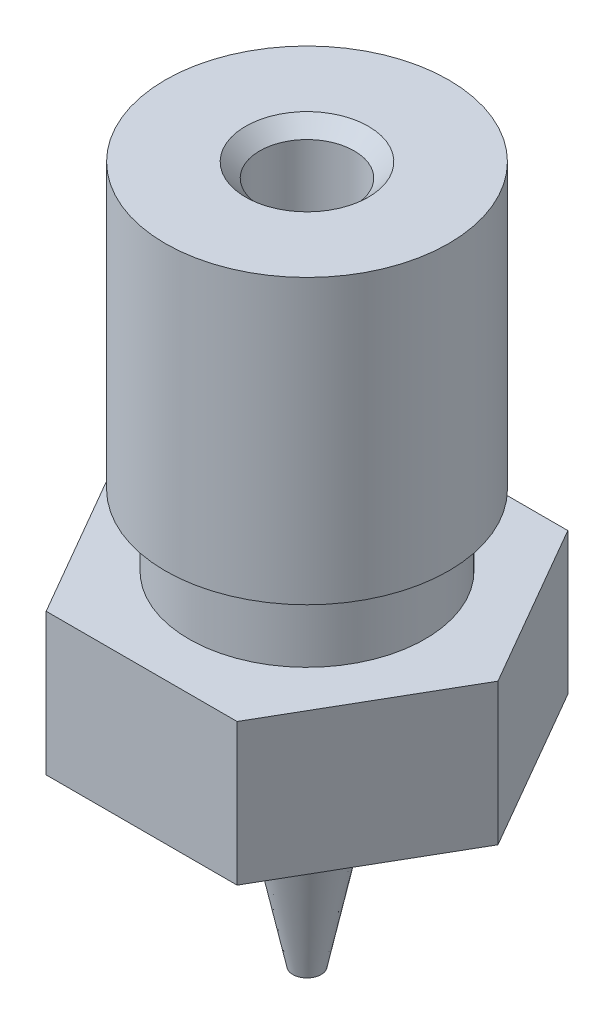
ISO-10303-21;
HEADER;
FILE_DESCRIPTION(('STEP AP214'),'2;1');
FILE_NAME('part.step','',(''),(''),'','','');
FILE_SCHEMA(('AUTOMOTIVE_DESIGN { 1 0 10303 214 1 1 1 1 }'));
ENDSEC;
DATA;
#1=APPLICATION_CONTEXT('core data for automotive mechanical design processes');
#2=APPLICATION_PROTOCOL_DEFINITION('international standard','automotive_design',2000,#1);
#3=PRODUCT_CONTEXT('',#1,'mechanical');
#4=PRODUCT('Part','Part','',(#3));
#5=PRODUCT_RELATED_PRODUCT_CATEGORY('part','',(#4));
#6=PRODUCT_DEFINITION_FORMATION('','',#4);
#7=PRODUCT_DEFINITION_CONTEXT('part definition',#1,'design');
#8=PRODUCT_DEFINITION('design','',#6,#7);
#9=PRODUCT_DEFINITION_SHAPE('','',#8);
#10=(LENGTH_UNIT() NAMED_UNIT(*) SI_UNIT(.MILLI.,.METRE.));
#11=(NAMED_UNIT(*) PLANE_ANGLE_UNIT() SI_UNIT($,.RADIAN.));
#12=(NAMED_UNIT(*) SI_UNIT($,.STERADIAN.) SOLID_ANGLE_UNIT());
#13=UNCERTAINTY_MEASURE_WITH_UNIT(LENGTH_MEASURE(1.E-05),#10,'distance_accuracy_value','');
#14=(GEOMETRIC_REPRESENTATION_CONTEXT(3) GLOBAL_UNCERTAINTY_ASSIGNED_CONTEXT((#13)) GLOBAL_UNIT_ASSIGNED_CONTEXT((#10,
#11,#12)) REPRESENTATION_CONTEXT('',''));
#15=CARTESIAN_POINT('',(0.,0.,0.));
#16=DIRECTION('',(0.,0.,1.));
#17=DIRECTION('',(1.,0.,0.));
#18=AXIS2_PLACEMENT_3D('',#15,#16,#17);
#19=CARTESIAN_POINT('',(0.,0.,0.));
#20=DIRECTION('',(0.,1.,0.));
#21=DIRECTION('',(-1.,0.,0.));
#22=AXIS2_PLACEMENT_3D('',#19,#20,#21);
#23=CONICAL_SURFACE('',#22,0.500000000000001,0.610865238198013);
#24=CARTESIAN_POINT('',(0.,2.,0.));
#25=DIRECTION('',(0.,1.,0.));
#26=DIRECTION('',(-1.,0.,0.));
#27=AXIS2_PLACEMENT_3D('',#24,#25,#26);
#28=CIRCLE('',#27,1.90041507641941);
#29=CARTESIAN_POINT('',(-1.90041507641941,2.,0.));
#30=VERTEX_POINT('',#29);
#31=EDGE_CURVE('E78',#30,#30,#28,.T.);
#32=ORIENTED_EDGE('',*,*,#31,.F.);
#33=EDGE_LOOP('',(#32));
#34=FACE_BOUND('',#33,.T.);
#35=CARTESIAN_POINT('',(0.,1.1425184053937,0.));
#36=DIRECTION('',(0.,1.,0.));
#37=DIRECTION('',(-1.,0.,0.));
#38=AXIS2_PLACEMENT_3D('',#35,#36,#37);
#39=CIRCLE('',#38,1.3);
#40=CARTESIAN_POINT('',(-1.3,1.1425184053937,0.));
#41=VERTEX_POINT('',#40);
#42=EDGE_CURVE('E12',#41,#41,#39,.F.);
#43=ORIENTED_EDGE('',*,*,#42,.F.);
#44=EDGE_LOOP('',(#43));
#45=FACE_BOUND('',#44,.T.);
#46=ADVANCED_FACE('F70',(#34,#45),#23,.T.);
#47=CARTESIAN_POINT('',(1.90041507641941,2.,0.));
#48=DIRECTION('',(0.,1.,0.));
#49=DIRECTION('',(-1.,0.,0.));
#50=AXIS2_PLACEMENT_3D('',#47,#48,#49);
#51=PLANE('',#50);
#52=DIRECTION('',(0.499999999999999,0.,0.866025403784439));
#53=VECTOR('',#52,1.);
#54=CARTESIAN_POINT('',(3.03108891324554,2.,-1.75));
#55=LINE('',#54,#53);
#56=CARTESIAN_POINT('',(2.02072594216369,2.,-3.5));
#57=VERTEX_POINT('',#56);
#58=CARTESIAN_POINT('',(4.04145188432738,2.,0.));
#59=VERTEX_POINT('',#58);
#60=EDGE_CURVE('E155',#57,#59,#55,.T.);
#61=ORIENTED_EDGE('',*,*,#60,.T.);
#62=DIRECTION('',(-0.5,0.,0.866025403784439));
#63=VECTOR('',#62,1.);
#64=CARTESIAN_POINT('',(3.03108891324553,2.,1.75));
#65=LINE('',#64,#63);
#66=CARTESIAN_POINT('',(2.02072594216369,2.,3.5));
#67=VERTEX_POINT('',#66);
#68=EDGE_CURVE('E142',#59,#67,#65,.T.);
#69=ORIENTED_EDGE('',*,*,#68,.T.);
#70=DIRECTION('',(-1.,0.,0.));
#71=VECTOR('',#70,1.);
#72=CARTESIAN_POINT('',(0.,2.,3.5));
#73=LINE('',#72,#71);
#74=CARTESIAN_POINT('',(-2.02072594216369,2.,3.5));
#75=VERTEX_POINT('',#74);
#76=EDGE_CURVE('E166',#67,#75,#73,.T.);
#77=ORIENTED_EDGE('',*,*,#76,.T.);
#78=DIRECTION('',(-0.5,0.,-0.866025403784439));
#79=VECTOR('',#78,1.);
#80=CARTESIAN_POINT('',(-3.03108891324554,2.,1.75));
#81=LINE('',#80,#79);
#82=CARTESIAN_POINT('',(-4.04145188432738,2.,0.));
#83=VERTEX_POINT('',#82);
#84=EDGE_CURVE('E169',#75,#83,#81,.T.);
#85=ORIENTED_EDGE('',*,*,#84,.T.);
#86=DIRECTION('',(0.5,0.,-0.866025403784438));
#87=VECTOR('',#86,1.);
#88=CARTESIAN_POINT('',(-3.03108891324553,2.,-1.75));
#89=LINE('',#88,#87);
#90=CARTESIAN_POINT('',(-2.02072594216369,2.,-3.5));
#91=VERTEX_POINT('',#90);
#92=EDGE_CURVE('E175',#83,#91,#89,.T.);
#93=ORIENTED_EDGE('',*,*,#92,.T.);
#94=DIRECTION('',(1.,0.,0.));
#95=VECTOR('',#94,1.);
#96=CARTESIAN_POINT('',(0.,2.,-3.5));
#97=LINE('',#96,#95);
#98=EDGE_CURVE('E148',#91,#57,#97,.T.);
#99=ORIENTED_EDGE('',*,*,#98,.T.);
#100=EDGE_LOOP('',(#61,#69,#77,#85,#93,#99));
#101=FACE_BOUND('',#100,.T.);
#102=ORIENTED_EDGE('',*,*,#31,.T.);
#103=EDGE_LOOP('',(#102));
#104=FACE_BOUND('',#103,.T.);
#105=ADVANCED_FACE('F207',(#101,#104),#51,.F.);
#106=CARTESIAN_POINT('',(3.5,5.,0.));
#107=DIRECTION('',(0.,-1.,0.));
#108=DIRECTION('',(1.,0.,0.));
#109=AXIS2_PLACEMENT_3D('',#106,#107,#108);
#110=PLANE('',#109);
#111=CARTESIAN_POINT('',(0.,5.,0.));
#112=DIRECTION('',(0.,1.,0.));
#113=DIRECTION('',(-1.,0.,0.));
#114=AXIS2_PLACEMENT_3D('',#111,#112,#113);
#115=CIRCLE('',#114,2.5);
#116=CARTESIAN_POINT('',(-2.5,5.,0.));
#117=VERTEX_POINT('',#116);
#118=EDGE_CURVE('E202',#117,#117,#115,.T.);
#119=ORIENTED_EDGE('',*,*,#118,.F.);
#120=EDGE_LOOP('',(#119));
#121=FACE_BOUND('',#120,.T.);
#122=DIRECTION('',(-0.5,0.,-0.866025403784439));
#123=VECTOR('',#122,1.);
#124=CARTESIAN_POINT('',(-3.03108891324554,5.,1.75));
#125=LINE('',#124,#123);
#126=CARTESIAN_POINT('',(-2.02072594216369,5.,3.5));
#127=VERTEX_POINT('',#126);
#128=CARTESIAN_POINT('',(-4.04145188432738,5.,0.));
#129=VERTEX_POINT('',#128);
#130=EDGE_CURVE('E171',#127,#129,#125,.T.);
#131=ORIENTED_EDGE('',*,*,#130,.F.);
#132=DIRECTION('',(-1.,0.,0.));
#133=VECTOR('',#132,1.);
#134=CARTESIAN_POINT('',(0.,5.,3.5));
#135=LINE('',#134,#133);
#136=CARTESIAN_POINT('',(2.02072594216369,5.,3.5));
#137=VERTEX_POINT('',#136);
#138=EDGE_CURVE('E125',#137,#127,#135,.T.);
#139=ORIENTED_EDGE('',*,*,#138,.F.);
#140=DIRECTION('',(-0.5,0.,0.866025403784439));
#141=VECTOR('',#140,1.);
#142=CARTESIAN_POINT('',(3.03108891324553,5.,1.75));
#143=LINE('',#142,#141);
#144=CARTESIAN_POINT('',(4.04145188432738,5.,0.));
#145=VERTEX_POINT('',#144);
#146=EDGE_CURVE('E118',#145,#137,#143,.T.);
#147=ORIENTED_EDGE('',*,*,#146,.F.);
#148=DIRECTION('',(0.499999999999999,0.,0.866025403784439));
#149=VECTOR('',#148,1.);
#150=CARTESIAN_POINT('',(3.03108891324554,5.,-1.75));
#151=LINE('',#150,#149);
#152=CARTESIAN_POINT('',(2.02072594216369,5.,-3.5));
#153=VERTEX_POINT('',#152);
#154=EDGE_CURVE('E122',#153,#145,#151,.T.);
#155=ORIENTED_EDGE('',*,*,#154,.F.);
#156=DIRECTION('',(1.,0.,0.));
#157=VECTOR('',#156,1.);
#158=CARTESIAN_POINT('',(0.,5.,-3.5));
#159=LINE('',#158,#157);
#160=CARTESIAN_POINT('',(-2.02072594216369,5.,-3.5));
#161=VERTEX_POINT('',#160);
#162=EDGE_CURVE('E138',#161,#153,#159,.T.);
#163=ORIENTED_EDGE('',*,*,#162,.F.);
#164=DIRECTION('',(0.5,0.,-0.866025403784438));
#165=VECTOR('',#164,1.);
#166=CARTESIAN_POINT('',(-3.03108891324553,5.,-1.75));
#167=LINE('',#166,#165);
#168=EDGE_CURVE('E174',#129,#161,#167,.T.);
#169=ORIENTED_EDGE('',*,*,#168,.F.);
#170=EDGE_LOOP('',(#131,#139,#147,#155,#163,#169));
#171=FACE_BOUND('',#170,.T.);
#172=ADVANCED_FACE('F120',(#121,#171),#110,.F.);
#173=CARTESIAN_POINT('',(0.,-1.12913310004202,0.));
#174=DIRECTION('',(0.,1.,0.));
#175=DIRECTION('',(-1.,0.,0.));
#176=AXIS2_PLACEMENT_3D('',#173,#174,#175);
#177=CYLINDRICAL_SURFACE('',#176,2.5);
#178=CARTESIAN_POINT('',(0.,6.5,0.));
#179=DIRECTION('',(0.,1.,0.));
#180=DIRECTION('',(-1.,0.,0.));
#181=AXIS2_PLACEMENT_3D('',#178,#179,#180);
#182=CIRCLE('',#181,2.5);
#183=CARTESIAN_POINT('',(-2.5,6.5,0.));
#184=VERTEX_POINT('',#183);
#185=EDGE_CURVE('E199',#184,#184,#182,.T.);
#186=ORIENTED_EDGE('',*,*,#185,.F.);
#187=EDGE_LOOP('',(#186));
#188=FACE_BOUND('',#187,.T.);
#189=ORIENTED_EDGE('',*,*,#118,.T.);
#190=EDGE_LOOP('',(#189));
#191=FACE_BOUND('',#190,.T.);
#192=ADVANCED_FACE('F283',(#188,#191),#177,.T.);
#193=CARTESIAN_POINT('',(2.5,6.5,0.));
#194=DIRECTION('',(0.,1.,0.));
#195=DIRECTION('',(-1.,0.,0.));
#196=AXIS2_PLACEMENT_3D('',#193,#194,#195);
#197=PLANE('',#196);
#198=CARTESIAN_POINT('',(0.,6.5,0.));
#199=DIRECTION('',(0.,1.,0.));
#200=DIRECTION('',(-1.,0.,0.));
#201=AXIS2_PLACEMENT_3D('',#198,#199,#200);
#202=CIRCLE('',#201,3.);
#203=CARTESIAN_POINT('',(-3.,6.5,0.));
#204=VERTEX_POINT('',#203);
#205=EDGE_CURVE('E196',#204,#204,#202,.T.);
#206=ORIENTED_EDGE('',*,*,#205,.F.);
#207=EDGE_LOOP('',(#206));
#208=FACE_BOUND('',#207,.T.);
#209=ORIENTED_EDGE('',*,*,#185,.T.);
#210=EDGE_LOOP('',(#209));
#211=FACE_BOUND('',#210,.T.);
#212=ADVANCED_FACE('F279',(#208,#211),#197,.F.);
#213=CARTESIAN_POINT('',(0.,-1.12913310004202,0.));
#214=DIRECTION('',(0.,1.,0.));
#215=DIRECTION('',(-1.,0.,0.));
#216=AXIS2_PLACEMENT_3D('',#213,#214,#215);
#217=CYLINDRICAL_SURFACE('',#216,3.);
#218=CARTESIAN_POINT('',(0.,12.5,0.));
#219=DIRECTION('',(0.,1.,0.));
#220=DIRECTION('',(-1.,0.,0.));
#221=AXIS2_PLACEMENT_3D('',#218,#219,#220);
#222=CIRCLE('',#221,3.);
#223=CARTESIAN_POINT('',(-3.,12.5,0.));
#224=VERTEX_POINT('',#223);
#225=EDGE_CURVE('E193',#224,#224,#222,.T.);
#226=ORIENTED_EDGE('',*,*,#225,.F.);
#227=EDGE_LOOP('',(#226));
#228=FACE_BOUND('',#227,.T.);
#229=ORIENTED_EDGE('',*,*,#205,.T.);
#230=EDGE_LOOP('',(#229));
#231=FACE_BOUND('',#230,.T.);
#232=ADVANCED_FACE('F275',(#228,#231),#217,.T.);
#233=CARTESIAN_POINT('',(3.,12.5,0.));
#234=DIRECTION('',(0.,-1.,0.));
#235=DIRECTION('',(1.,0.,0.));
#236=AXIS2_PLACEMENT_3D('',#233,#234,#235);
#237=PLANE('',#236);
#238=CARTESIAN_POINT('',(0.,12.5,0.));
#239=DIRECTION('',(0.,-1.,0.));
#240=DIRECTION('',(0.,0.,-1.));
#241=AXIS2_PLACEMENT_3D('',#238,#239,#240);
#242=CIRCLE('',#241,1.3);
#243=CARTESIAN_POINT('',(0.,12.5,-1.3));
#244=VERTEX_POINT('',#243);
#245=EDGE_CURVE('E190',#244,#244,#242,.T.);
#246=ORIENTED_EDGE('',*,*,#245,.T.);
#247=EDGE_LOOP('',(#246));
#248=FACE_BOUND('',#247,.T.);
#249=ORIENTED_EDGE('',*,*,#225,.T.);
#250=EDGE_LOOP('',(#249));
#251=FACE_BOUND('',#250,.T.);
#252=ADVANCED_FACE('F271',(#248,#251),#237,.F.);
#253=CARTESIAN_POINT('',(0.,12.2,0.));
#254=DIRECTION('',(0.,1.,0.));
#255=DIRECTION('',(0.,0.,1.));
#256=AXIS2_PLACEMENT_3D('',#253,#254,#255);
#257=CONICAL_SURFACE('',#256,1.,0.785398163397445);
#258=ORIENTED_EDGE('',*,*,#245,.F.);
#259=EDGE_LOOP('',(#258));
#260=FACE_BOUND('',#259,.T.);
#261=CARTESIAN_POINT('',(0.,12.2,0.));
#262=DIRECTION('',(0.,-1.,0.));
#263=DIRECTION('',(0.,0.,-1.));
#264=AXIS2_PLACEMENT_3D('',#261,#262,#263);
#265=CIRCLE('',#264,1.);
#266=CARTESIAN_POINT('',(0.,12.2,-1.));
#267=VERTEX_POINT('',#266);
#268=EDGE_CURVE('E187',#267,#267,#265,.T.);
#269=ORIENTED_EDGE('',*,*,#268,.T.);
#270=EDGE_LOOP('',(#269));
#271=FACE_BOUND('',#270,.T.);
#272=ADVANCED_FACE('F267',(#260,#271),#257,.F.);
#273=CARTESIAN_POINT('',(0.,0.,0.));
#274=DIRECTION('',(0.,-1.,0.));
#275=DIRECTION('',(0.,0.,-1.));
#276=AXIS2_PLACEMENT_3D('',#273,#274,#275);
#277=CYLINDRICAL_SURFACE('',#276,1.);
#278=ORIENTED_EDGE('',*,*,#268,.F.);
#279=EDGE_LOOP('',(#278));
#280=FACE_BOUND('',#279,.T.);
#281=CARTESIAN_POINT('',(0.,1.9856406460551,0.));
#282=DIRECTION('',(0.,-1.,0.));
#283=DIRECTION('',(0.,0.,-1.));
#284=AXIS2_PLACEMENT_3D('',#281,#282,#283);
#285=CIRCLE('',#284,1.);
#286=CARTESIAN_POINT('',(0.,1.9856406460551,-1.));
#287=VERTEX_POINT('',#286);
#288=EDGE_CURVE('E184',#287,#287,#285,.T.);
#289=ORIENTED_EDGE('',*,*,#288,.T.);
#290=EDGE_LOOP('',(#289));
#291=FACE_BOUND('',#290,.T.);
#292=ADVANCED_FACE('F263',(#280,#291),#277,.F.);
#293=CARTESIAN_POINT('',(0.,0.6,0.));
#294=DIRECTION('',(0.,1.,0.));
#295=DIRECTION('',(0.,0.,1.));
#296=AXIS2_PLACEMENT_3D('',#293,#294,#295);
#297=CONICAL_SURFACE('',#296,0.2,0.5235987755983);
#298=ORIENTED_EDGE('',*,*,#288,.F.);
#299=EDGE_LOOP('',(#298));
#300=FACE_BOUND('',#299,.T.);
#301=CARTESIAN_POINT('',(0.,0.6,0.));
#302=DIRECTION('',(0.,-1.,0.));
#303=DIRECTION('',(0.,0.,-1.));
#304=AXIS2_PLACEMENT_3D('',#301,#302,#303);
#305=CIRCLE('',#304,0.2);
#306=CARTESIAN_POINT('',(0.,0.6,-0.2));
#307=VERTEX_POINT('',#306);
#308=EDGE_CURVE('E181',#307,#307,#305,.T.);
#309=ORIENTED_EDGE('',*,*,#308,.T.);
#310=EDGE_LOOP('',(#309));
#311=FACE_BOUND('',#310,.T.);
#312=ADVANCED_FACE('F259',(#300,#311),#297,.F.);
#313=CARTESIAN_POINT('',(0.,0.,0.));
#314=DIRECTION('',(0.,-1.,0.));
#315=DIRECTION('',(0.,0.,-1.));
#316=AXIS2_PLACEMENT_3D('',#313,#314,#315);
#317=CYLINDRICAL_SURFACE('',#316,0.2);
#318=ORIENTED_EDGE('',*,*,#308,.F.);
#319=EDGE_LOOP('',(#318));
#320=FACE_BOUND('',#319,.T.);
#321=CARTESIAN_POINT('',(0.,0.,0.));
#322=DIRECTION('',(0.,1.,0.));
#323=DIRECTION('',(-1.,0.,0.));
#324=AXIS2_PLACEMENT_3D('',#321,#322,#323);
#325=CIRCLE('',#324,0.200000000000001);
#326=CARTESIAN_POINT('',(-0.200000000000001,0.,0.));
#327=VERTEX_POINT('',#326);
#328=EDGE_CURVE('E145',#327,#327,#325,.T.);
#329=ORIENTED_EDGE('',*,*,#328,.F.);
#330=EDGE_LOOP('',(#329));
#331=FACE_BOUND('',#330,.T.);
#332=ADVANCED_FACE('F255',(#320,#331),#317,.F.);
#333=CARTESIAN_POINT('',(-3.03108891324554,5.,1.75));
#334=DIRECTION('',(-0.866025403784439,0.,0.5));
#335=DIRECTION('',(0.5,0.,0.866025403784439));
#336=AXIS2_PLACEMENT_3D('',#333,#334,#335);
#337=PLANE('',#336);
#338=ORIENTED_EDGE('',*,*,#84,.F.);
#339=DIRECTION('',(0.,-1.,0.));
#340=VECTOR('',#339,1.);
#341=CARTESIAN_POINT('',(-2.02072594216369,5.,3.5));
#342=LINE('',#341,#340);
#343=EDGE_CURVE('E163',#127,#75,#342,.T.);
#344=ORIENTED_EDGE('',*,*,#343,.F.);
#345=ORIENTED_EDGE('',*,*,#130,.T.);
#346=DIRECTION('',(0.,-1.,0.));
#347=VECTOR('',#346,1.);
#348=CARTESIAN_POINT('',(-4.04145188432738,5.,0.));
#349=LINE('',#348,#347);
#350=EDGE_CURVE('E84',#129,#83,#349,.T.);
#351=ORIENTED_EDGE('',*,*,#350,.T.);
#352=EDGE_LOOP('',(#338,#344,#345,#351));
#353=FACE_BOUND('',#352,.T.);
#354=ADVANCED_FACE('F252',(#353),#337,.T.);
#355=CARTESIAN_POINT('',(-3.03108891324553,5.,-1.75));
#356=DIRECTION('',(-0.866025403784438,0.,-0.5));
#357=DIRECTION('',(-0.5,0.,0.866025403784439));
#358=AXIS2_PLACEMENT_3D('',#355,#356,#357);
#359=PLANE('',#358);
#360=ORIENTED_EDGE('',*,*,#92,.F.);
#361=ORIENTED_EDGE('',*,*,#350,.F.);
#362=ORIENTED_EDGE('',*,*,#168,.T.);
#363=DIRECTION('',(0.,-1.,0.));
#364=VECTOR('',#363,1.);
#365=CARTESIAN_POINT('',(-2.02072594216369,5.,-3.5));
#366=LINE('',#365,#364);
#367=EDGE_CURVE('E144',#161,#91,#366,.T.);
#368=ORIENTED_EDGE('',*,*,#367,.T.);
#369=EDGE_LOOP('',(#360,#361,#362,#368));
#370=FACE_BOUND('',#369,.T.);
#371=ADVANCED_FACE('F248',(#370),#359,.T.);
#372=CARTESIAN_POINT('',(0.,5.,3.5));
#373=DIRECTION('',(0.,0.,1.));
#374=DIRECTION('',(1.,0.,0.));
#375=AXIS2_PLACEMENT_3D('',#372,#373,#374);
#376=PLANE('',#375);
#377=ORIENTED_EDGE('',*,*,#76,.F.);
#378=DIRECTION('',(0.,-1.,0.));
#379=VECTOR('',#378,1.);
#380=CARTESIAN_POINT('',(2.02072594216369,5.,3.5));
#381=LINE('',#380,#379);
#382=EDGE_CURVE('E130',#137,#67,#381,.T.);
#383=ORIENTED_EDGE('',*,*,#382,.F.);
#384=ORIENTED_EDGE('',*,*,#138,.T.);
#385=ORIENTED_EDGE('',*,*,#343,.T.);
#386=EDGE_LOOP('',(#377,#383,#384,#385));
#387=FACE_BOUND('',#386,.T.);
#388=ADVANCED_FACE('F245',(#387),#376,.T.);
#389=CARTESIAN_POINT('',(3.03108891324553,5.,1.75));
#390=DIRECTION('',(0.866025403784439,0.,0.5));
#391=DIRECTION('',(0.5,0.,-0.866025403784439));
#392=AXIS2_PLACEMENT_3D('',#389,#390,#391);
#393=PLANE('',#392);
#394=ORIENTED_EDGE('',*,*,#68,.F.);
#395=DIRECTION('',(0.,-1.,0.));
#396=VECTOR('',#395,1.);
#397=CARTESIAN_POINT('',(4.04145188432738,5.,0.));
#398=LINE('',#397,#396);
#399=EDGE_CURVE('E137',#145,#59,#398,.T.);
#400=ORIENTED_EDGE('',*,*,#399,.F.);
#401=ORIENTED_EDGE('',*,*,#146,.T.);
#402=ORIENTED_EDGE('',*,*,#382,.T.);
#403=EDGE_LOOP('',(#394,#400,#401,#402));
#404=FACE_BOUND('',#403,.T.);
#405=ADVANCED_FACE('F140',(#404),#393,.T.);
#406=CARTESIAN_POINT('',(0.,5.,-3.5));
#407=DIRECTION('',(0.,0.,-1.));
#408=DIRECTION('',(-1.,0.,0.));
#409=AXIS2_PLACEMENT_3D('',#406,#407,#408);
#410=PLANE('',#409);
#411=ORIENTED_EDGE('',*,*,#98,.F.);
#412=ORIENTED_EDGE('',*,*,#367,.F.);
#413=ORIENTED_EDGE('',*,*,#162,.T.);
#414=DIRECTION('',(0.,-1.,0.));
#415=VECTOR('',#414,1.);
#416=CARTESIAN_POINT('',(2.02072594216369,5.,-3.5));
#417=LINE('',#416,#415);
#418=EDGE_CURVE('E131',#153,#57,#417,.T.);
#419=ORIENTED_EDGE('',*,*,#418,.T.);
#420=EDGE_LOOP('',(#411,#412,#413,#419));
#421=FACE_BOUND('',#420,.T.);
#422=ADVANCED_FACE('F239',(#421),#410,.T.);
#423=CARTESIAN_POINT('',(3.03108891324554,5.,-1.75));
#424=DIRECTION('',(0.866025403784439,0.,-0.499999999999999));
#425=DIRECTION('',(-0.499999999999999,0.,-0.866025403784439));
#426=AXIS2_PLACEMENT_3D('',#423,#424,#425);
#427=PLANE('',#426);
#428=ORIENTED_EDGE('',*,*,#60,.F.);
#429=ORIENTED_EDGE('',*,*,#418,.F.);
#430=ORIENTED_EDGE('',*,*,#154,.T.);
#431=ORIENTED_EDGE('',*,*,#399,.T.);
#432=EDGE_LOOP('',(#428,#429,#430,#431));
#433=FACE_BOUND('',#432,.T.);
#434=ADVANCED_FACE('F136',(#433),#427,.T.);
#435=CARTESIAN_POINT('',(0.,0.,0.));
#436=DIRECTION('',(0.,-1.,0.));
#437=DIRECTION('',(1.,0.,0.));
#438=AXIS2_PLACEMENT_3D('',#435,#436,#437);
#439=PLANE('',#438);
#440=ORIENTED_EDGE('',*,*,#328,.T.);
#441=EDGE_LOOP('',(#440));
#442=FACE_BOUND('',#441,.T.);
#443=ADVANCED_FACE('F216',(#442),#439,.F.);
#444=CARTESIAN_POINT('',(0.,2.,0.));
#445=DIRECTION('',(0.,1.,0.));
#446=DIRECTION('',(-1.,0.,0.));
#447=AXIS2_PLACEMENT_3D('',#444,#445,#446);
#448=CYLINDRICAL_SURFACE('',#447,1.3);
#449=CARTESIAN_POINT('',(0.,0.550000000000002,0.));
#450=DIRECTION('',(0.,1.,0.));
#451=DIRECTION('',(-1.,0.,0.));
#452=AXIS2_PLACEMENT_3D('',#449,#450,#451);
#453=CIRCLE('',#452,1.3);
#454=CARTESIAN_POINT('',(-1.3,0.550000000000001,0.));
#455=VERTEX_POINT('',#454);
#456=EDGE_CURVE('E502',#455,#455,#453,.T.);
#457=ORIENTED_EDGE('',*,*,#456,.T.);
#458=EDGE_LOOP('',(#457));
#459=FACE_BOUND('',#458,.T.);
#460=ORIENTED_EDGE('',*,*,#42,.T.);
#461=EDGE_LOOP('',(#460));
#462=FACE_BOUND('',#461,.T.);
#463=ADVANCED_FACE('F213',(#459,#462),#448,.T.);
#464=CARTESIAN_POINT('',(0.,-2.25,0.));
#465=DIRECTION('',(0.,1.,0.));
#466=DIRECTION('',(-1.,0.,0.));
#467=AXIS2_PLACEMENT_3D('',#464,#465,#466);
#468=PLANE('',#467);
#469=CARTESIAN_POINT('',(0.,-2.25,0.));
#470=DIRECTION('',(0.,1.,0.));
#471=DIRECTION('',(-1.,0.,0.));
#472=AXIS2_PLACEMENT_3D('',#469,#470,#471);
#473=CIRCLE('',#472,0.3);
#474=CARTESIAN_POINT('',(-0.299999999999999,-2.25,0.));
#475=VERTEX_POINT('',#474);
#476=EDGE_CURVE('E151',#475,#475,#473,.T.);
#477=ORIENTED_EDGE('',*,*,#476,.F.);
#478=EDGE_LOOP('',(#477));
#479=FACE_BOUND('',#478,.T.);
#480=ADVANCED_FACE('F215',(#479),#468,.F.);
#481=CARTESIAN_POINT('',(0.,-2.25,0.));
#482=DIRECTION('',(0.,1.,0.));
#483=DIRECTION('',(-1.,0.,0.));
#484=AXIS2_PLACEMENT_3D('',#481,#482,#483);
#485=CONICAL_SURFACE('',#484,0.3,0.206004860152089);
#486=CARTESIAN_POINT('',(0.,0.550000000000002,0.));
#487=DIRECTION('',(0.,1.,0.));
#488=DIRECTION('',(-1.,0.,0.));
#489=AXIS2_PLACEMENT_3D('',#486,#487,#488);
#490=CIRCLE('',#489,0.88511414601534);
#491=CARTESIAN_POINT('',(-0.885114146015341,0.550000000000002,0.));
#492=VERTEX_POINT('',#491);
#493=EDGE_CURVE('E499',#492,#492,#490,.T.);
#494=ORIENTED_EDGE('',*,*,#493,.F.);
#495=EDGE_LOOP('',(#494));
#496=FACE_BOUND('',#495,.T.);
#497=ORIENTED_EDGE('',*,*,#476,.T.);
#498=EDGE_LOOP('',(#497));
#499=FACE_BOUND('',#498,.T.);
#500=ADVANCED_FACE('F223',(#496,#499),#485,.T.);
#501=CARTESIAN_POINT('',(0.,0.550000000000002,0.));
#502=DIRECTION('',(0.,1.,0.));
#503=DIRECTION('',(-1.,0.,0.));
#504=AXIS2_PLACEMENT_3D('',#501,#502,#503);
#505=PLANE('',#504);
#506=ORIENTED_EDGE('',*,*,#456,.F.);
#507=EDGE_LOOP('',(#506));
#508=FACE_BOUND('',#507,.T.);
#509=ORIENTED_EDGE('',*,*,#493,.T.);
#510=EDGE_LOOP('',(#509));
#511=FACE_BOUND('',#510,.T.);
#512=ADVANCED_FACE('F230',(#508,#511),#505,.F.);
#513=CLOSED_SHELL('',(#46,#105,#172,#192,#212,#232,#252,#272,#292,#312,#332,#354,#371,#388,#405,
#422,#434,#443,#463,#480,#500,#512));
#514=MANIFOLD_SOLID_BREP('B2',#513);
#515=ADVANCED_BREP_SHAPE_REPRESENTATION('',(#18,#514),#14);
#516=SHAPE_DEFINITION_REPRESENTATION(#9,#515);
ENDSEC;
END-ISO-10303-21;
